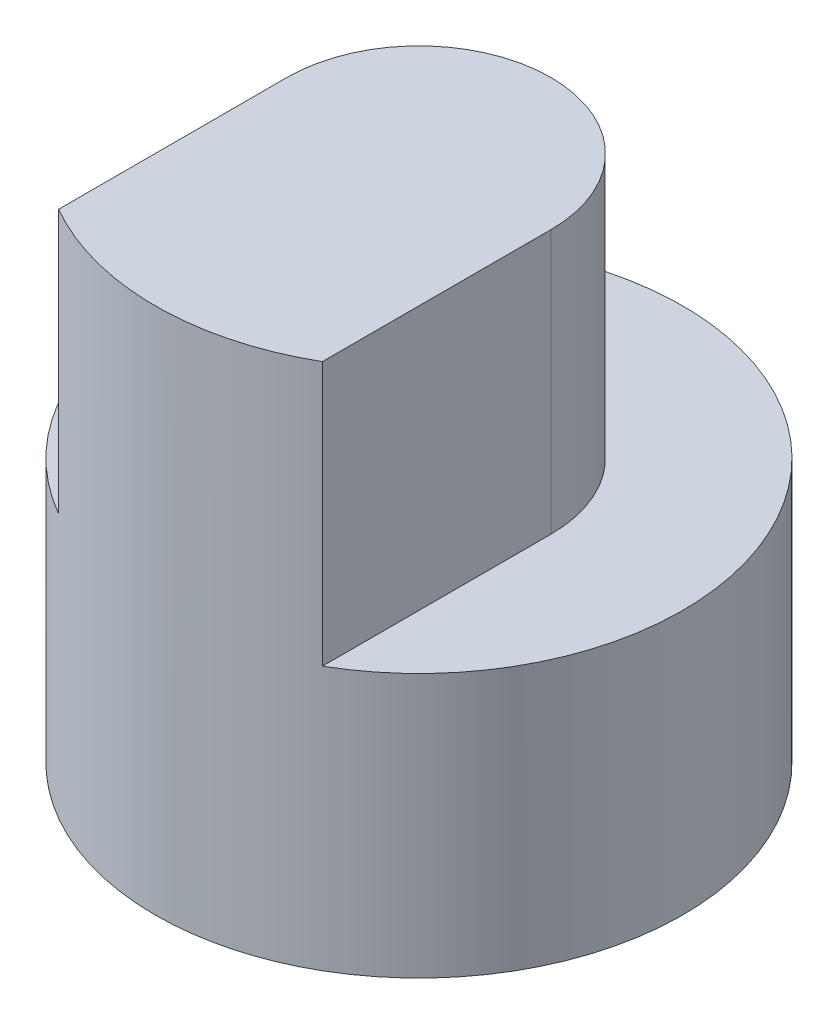
ISO-10303-21;
HEADER;
FILE_DESCRIPTION(('STEP AP214'),'2;1');
FILE_NAME('part.step','',(''),(''),'','','');
FILE_SCHEMA(('AUTOMOTIVE_DESIGN { 1 0 10303 214 1 1 1 1 }'));
ENDSEC;
DATA;
#1=APPLICATION_CONTEXT('core data for automotive mechanical design processes');
#2=APPLICATION_PROTOCOL_DEFINITION('international standard','automotive_design',2000,#1);
#3=PRODUCT_CONTEXT('',#1,'mechanical');
#4=PRODUCT('Part','Part','',(#3));
#5=PRODUCT_RELATED_PRODUCT_CATEGORY('part','',(#4));
#6=PRODUCT_DEFINITION_FORMATION('','',#4);
#7=PRODUCT_DEFINITION_CONTEXT('part definition',#1,'design');
#8=PRODUCT_DEFINITION('design','',#6,#7);
#9=PRODUCT_DEFINITION_SHAPE('','',#8);
#10=(LENGTH_UNIT() NAMED_UNIT(*) SI_UNIT(.MILLI.,.METRE.));
#11=(NAMED_UNIT(*) PLANE_ANGLE_UNIT() SI_UNIT($,.RADIAN.));
#12=(NAMED_UNIT(*) SI_UNIT($,.STERADIAN.) SOLID_ANGLE_UNIT());
#13=UNCERTAINTY_MEASURE_WITH_UNIT(LENGTH_MEASURE(1.E-05),#10,'distance_accuracy_value','');
#14=(GEOMETRIC_REPRESENTATION_CONTEXT(3) GLOBAL_UNCERTAINTY_ASSIGNED_CONTEXT((#13)) GLOBAL_UNIT_ASSIGNED_CONTEXT((#10,
#11,#12)) REPRESENTATION_CONTEXT('',''));
#15=CARTESIAN_POINT('',(0.,0.,0.));
#16=DIRECTION('',(0.,0.,1.));
#17=DIRECTION('',(1.,0.,0.));
#18=AXIS2_PLACEMENT_3D('',#15,#16,#17);
#19=CARTESIAN_POINT('',(0.,2.,0.));
#20=DIRECTION('',(0.,-1.,0.));
#21=DIRECTION('',(0.,0.,-1.));
#22=AXIS2_PLACEMENT_3D('',#19,#20,#21);
#23=CYLINDRICAL_SURFACE('',#22,2.);
#24=CARTESIAN_POINT('',(0.,2.,0.));
#25=DIRECTION('',(0.,1.,0.));
#26=DIRECTION('',(0.,0.,1.));
#27=AXIS2_PLACEMENT_3D('',#24,#25,#26);
#28=CIRCLE('',#27,2.);
#29=CARTESIAN_POINT('',(1.,2.,1.73205080756888));
#30=VERTEX_POINT('',#29);
#31=CARTESIAN_POINT('',(-1.,2.,1.73205080756888));
#32=VERTEX_POINT('',#31);
#33=EDGE_CURVE('E11',#30,#32,#28,.T.);
#34=ORIENTED_EDGE('',*,*,#33,.F.);
#35=DIRECTION('',(0.,-1.,0.));
#36=VECTOR('',#35,1.);
#37=CARTESIAN_POINT('',(1.,4.,1.73205080756888));
#38=LINE('',#37,#36);
#39=CARTESIAN_POINT('',(1.,4.,1.73205080756888));
#40=VERTEX_POINT('',#39);
#41=EDGE_CURVE('E74',#40,#30,#38,.T.);
#42=ORIENTED_EDGE('',*,*,#41,.F.);
#43=CARTESIAN_POINT('',(0.,4.,0.));
#44=DIRECTION('',(0.,1.,0.));
#45=DIRECTION('',(0.,0.,1.));
#46=AXIS2_PLACEMENT_3D('',#43,#44,#45);
#47=CIRCLE('',#46,2.);
#48=CARTESIAN_POINT('',(-1.,4.,1.73205080756888));
#49=VERTEX_POINT('',#48);
#50=EDGE_CURVE('E80',#49,#40,#47,.T.);
#51=ORIENTED_EDGE('',*,*,#50,.F.);
#52=DIRECTION('',(0.,-1.,0.));
#53=VECTOR('',#52,1.);
#54=CARTESIAN_POINT('',(-1.,4.,1.73205080756888));
#55=LINE('',#54,#53);
#56=EDGE_CURVE('E98',#49,#32,#55,.T.);
#57=ORIENTED_EDGE('',*,*,#56,.T.);
#58=EDGE_LOOP('',(#34,#42,#51,#57));
#59=FACE_BOUND('',#58,.T.);
#60=CARTESIAN_POINT('',(0.,0.,0.));
#61=DIRECTION('',(0.,1.,0.));
#62=DIRECTION('',(0.,0.,1.));
#63=AXIS2_PLACEMENT_3D('',#60,#61,#62);
#64=CIRCLE('',#63,2.);
#65=CARTESIAN_POINT('',(0.,0.,2.));
#66=VERTEX_POINT('',#65);
#67=EDGE_CURVE('E36',#66,#66,#64,.T.);
#68=ORIENTED_EDGE('',*,*,#67,.T.);
#69=EDGE_LOOP('',(#68));
#70=FACE_BOUND('',#69,.T.);
#71=ADVANCED_FACE('F33',(#59,#70),#23,.T.);
#72=CARTESIAN_POINT('',(0.,2.,0.));
#73=DIRECTION('',(0.,1.,0.));
#74=DIRECTION('',(0.,0.,1.));
#75=AXIS2_PLACEMENT_3D('',#72,#73,#74);
#76=PLANE('',#75);
#77=DIRECTION('',(0.,0.,1.));
#78=VECTOR('',#77,1.);
#79=CARTESIAN_POINT('',(-1.,2.,1.73205080756888));
#80=LINE('',#79,#78);
#81=CARTESIAN_POINT('',(-1.,2.,0.));
#82=VERTEX_POINT('',#81);
#83=EDGE_CURVE('E46',#82,#32,#80,.T.);
#84=ORIENTED_EDGE('',*,*,#83,.F.);
#85=CARTESIAN_POINT('',(0.,2.,0.));
#86=DIRECTION('',(0.,1.,0.));
#87=DIRECTION('',(0.,0.,-1.));
#88=AXIS2_PLACEMENT_3D('',#85,#86,#87);
#89=CIRCLE('',#88,1.);
#90=CARTESIAN_POINT('',(1.,2.,0.));
#91=VERTEX_POINT('',#90);
#92=EDGE_CURVE('E101',#91,#82,#89,.T.);
#93=ORIENTED_EDGE('',*,*,#92,.F.);
#94=DIRECTION('',(0.,0.,-1.));
#95=VECTOR('',#94,1.);
#96=CARTESIAN_POINT('',(1.,2.,0.));
#97=LINE('',#96,#95);
#98=EDGE_CURVE('E103',#30,#91,#97,.T.);
#99=ORIENTED_EDGE('',*,*,#98,.F.);
#100=ORIENTED_EDGE('',*,*,#33,.T.);
#101=EDGE_LOOP('',(#84,#93,#99,#100));
#102=FACE_BOUND('',#101,.T.);
#103=ADVANCED_FACE('F120',(#102),#76,.T.);
#104=CARTESIAN_POINT('',(0.,0.,0.));
#105=DIRECTION('',(0.,1.,0.));
#106=DIRECTION('',(0.,0.,1.));
#107=AXIS2_PLACEMENT_3D('',#104,#105,#106);
#108=PLANE('',#107);
#109=ORIENTED_EDGE('',*,*,#67,.F.);
#110=EDGE_LOOP('',(#109));
#111=FACE_BOUND('',#110,.T.);
#112=ADVANCED_FACE('F124',(#111),#108,.F.);
#113=CARTESIAN_POINT('',(1.,4.,0.));
#114=DIRECTION('',(-1.,0.,0.));
#115=DIRECTION('',(0.,0.,1.));
#116=AXIS2_PLACEMENT_3D('',#113,#114,#115);
#117=PLANE('',#116);
#118=ORIENTED_EDGE('',*,*,#98,.T.);
#119=DIRECTION('',(0.,-1.,0.));
#120=VECTOR('',#119,1.);
#121=CARTESIAN_POINT('',(1.,4.,0.));
#122=LINE('',#121,#120);
#123=CARTESIAN_POINT('',(1.,4.,0.));
#124=VERTEX_POINT('',#123);
#125=EDGE_CURVE('E76',#124,#91,#122,.T.);
#126=ORIENTED_EDGE('',*,*,#125,.F.);
#127=DIRECTION('',(0.,0.,-1.));
#128=VECTOR('',#127,1.);
#129=CARTESIAN_POINT('',(1.,4.,0.));
#130=LINE('',#129,#128);
#131=EDGE_CURVE('E69',#40,#124,#130,.T.);
#132=ORIENTED_EDGE('',*,*,#131,.F.);
#133=ORIENTED_EDGE('',*,*,#41,.T.);
#134=EDGE_LOOP('',(#118,#126,#132,#133));
#135=FACE_BOUND('',#134,.T.);
#136=ADVANCED_FACE('F72',(#135),#117,.F.);
#137=CARTESIAN_POINT('',(0.,4.,0.));
#138=DIRECTION('',(0.,-1.,0.));
#139=DIRECTION('',(0.,0.,-1.));
#140=AXIS2_PLACEMENT_3D('',#137,#138,#139);
#141=CYLINDRICAL_SURFACE('',#140,1.);
#142=ORIENTED_EDGE('',*,*,#92,.T.);
#143=DIRECTION('',(0.,-1.,0.));
#144=VECTOR('',#143,1.);
#145=CARTESIAN_POINT('',(-1.,4.,0.));
#146=LINE('',#145,#144);
#147=CARTESIAN_POINT('',(-1.,4.,0.));
#148=VERTEX_POINT('',#147);
#149=EDGE_CURVE('E93',#148,#82,#146,.T.);
#150=ORIENTED_EDGE('',*,*,#149,.F.);
#151=CARTESIAN_POINT('',(0.,4.,0.));
#152=DIRECTION('',(0.,1.,0.));
#153=DIRECTION('',(0.,0.,-1.));
#154=AXIS2_PLACEMENT_3D('',#151,#152,#153);
#155=CIRCLE('',#154,1.);
#156=EDGE_CURVE('E79',#124,#148,#155,.T.);
#157=ORIENTED_EDGE('',*,*,#156,.F.);
#158=ORIENTED_EDGE('',*,*,#125,.T.);
#159=EDGE_LOOP('',(#142,#150,#157,#158));
#160=FACE_BOUND('',#159,.T.);
#161=ADVANCED_FACE('F108',(#160),#141,.T.);
#162=CARTESIAN_POINT('',(-1.,4.,1.73205080756888));
#163=DIRECTION('',(1.,0.,0.));
#164=DIRECTION('',(0.,0.,-1.));
#165=AXIS2_PLACEMENT_3D('',#162,#163,#164);
#166=PLANE('',#165);
#167=ORIENTED_EDGE('',*,*,#83,.T.);
#168=ORIENTED_EDGE('',*,*,#56,.F.);
#169=DIRECTION('',(0.,0.,1.));
#170=VECTOR('',#169,1.);
#171=CARTESIAN_POINT('',(-1.,4.,1.73205080756888));
#172=LINE('',#171,#170);
#173=EDGE_CURVE('E85',#148,#49,#172,.T.);
#174=ORIENTED_EDGE('',*,*,#173,.F.);
#175=ORIENTED_EDGE('',*,*,#149,.T.);
#176=EDGE_LOOP('',(#167,#168,#174,#175));
#177=FACE_BOUND('',#176,.T.);
#178=ADVANCED_FACE('F110',(#177),#166,.F.);
#179=CARTESIAN_POINT('',(0.,4.,0.));
#180=DIRECTION('',(0.,1.,0.));
#181=DIRECTION('',(0.,0.,1.));
#182=AXIS2_PLACEMENT_3D('',#179,#180,#181);
#183=PLANE('',#182);
#184=ORIENTED_EDGE('',*,*,#50,.T.);
#185=ORIENTED_EDGE('',*,*,#131,.T.);
#186=ORIENTED_EDGE('',*,*,#156,.T.);
#187=ORIENTED_EDGE('',*,*,#173,.T.);
#188=EDGE_LOOP('',(#184,#185,#186,#187));
#189=FACE_BOUND('',#188,.T.);
#190=ADVANCED_FACE('F83',(#189),#183,.T.);
#191=CLOSED_SHELL('',(#71,#103,#112,#136,#161,#178,#190));
#192=MANIFOLD_SOLID_BREP('B2',#191);
#193=ADVANCED_BREP_SHAPE_REPRESENTATION('',(#18,#192),#14);
#194=SHAPE_DEFINITION_REPRESENTATION(#9,#193);
ENDSEC;
END-ISO-10303-21;
